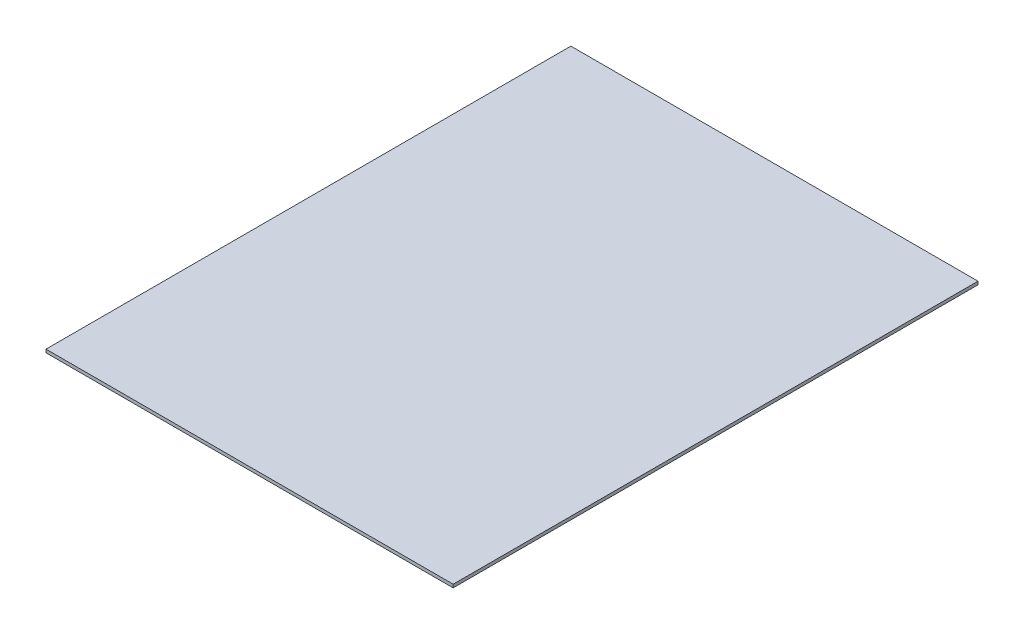
ISO-10303-21;
HEADER;
FILE_DESCRIPTION(('STEP AP214'),'2;1');
FILE_NAME('part.step','',(''),(''),'','','');
FILE_SCHEMA(('AUTOMOTIVE_DESIGN { 1 0 10303 214 1 1 1 1 }'));
ENDSEC;
DATA;
#1=APPLICATION_CONTEXT('core data for automotive mechanical design processes');
#2=APPLICATION_PROTOCOL_DEFINITION('international standard','automotive_design',2000,#1);
#3=PRODUCT_CONTEXT('',#1,'mechanical');
#4=PRODUCT('Part','Part','',(#3));
#5=PRODUCT_RELATED_PRODUCT_CATEGORY('part','',(#4));
#6=PRODUCT_DEFINITION_FORMATION('','',#4);
#7=PRODUCT_DEFINITION_CONTEXT('part definition',#1,'design');
#8=PRODUCT_DEFINITION('design','',#6,#7);
#9=PRODUCT_DEFINITION_SHAPE('','',#8);
#10=(LENGTH_UNIT() NAMED_UNIT(*) SI_UNIT(.MILLI.,.METRE.));
#11=(NAMED_UNIT(*) PLANE_ANGLE_UNIT() SI_UNIT($,.RADIAN.));
#12=(NAMED_UNIT(*) SI_UNIT($,.STERADIAN.) SOLID_ANGLE_UNIT());
#13=UNCERTAINTY_MEASURE_WITH_UNIT(LENGTH_MEASURE(1.E-05),#10,'distance_accuracy_value','');
#14=(GEOMETRIC_REPRESENTATION_CONTEXT(3) GLOBAL_UNCERTAINTY_ASSIGNED_CONTEXT((#13)) GLOBAL_UNIT_ASSIGNED_CONTEXT((#10,
#11,#12)) REPRESENTATION_CONTEXT('',''));
#15=CARTESIAN_POINT('',(0.,0.,0.));
#16=DIRECTION('',(0.,0.,1.));
#17=DIRECTION('',(1.,0.,0.));
#18=AXIS2_PLACEMENT_3D('',#15,#16,#17);
#19=CARTESIAN_POINT('',(-666.997518610422,10.,-646.352357320099));
#20=DIRECTION('',(1.,0.,0.));
#21=DIRECTION('',(0.,0.,-1.));
#22=AXIS2_PLACEMENT_3D('',#19,#20,#21);
#23=PLANE('',#22);
#24=DIRECTION('',(0.,0.,1.));
#25=VECTOR('',#24,1.);
#26=CARTESIAN_POINT('',(-666.997518610422,0.,-646.352357320099));
#27=LINE('',#26,#25);
#28=CARTESIAN_POINT('',(-666.997518610422,0.,-646.352357320099));
#29=VERTEX_POINT('',#28);
#30=CARTESIAN_POINT('',(-666.997518610422,0.,1003.6476426799));
#31=VERTEX_POINT('',#30);
#32=EDGE_CURVE('E96',#29,#31,#27,.T.);
#33=ORIENTED_EDGE('',*,*,#32,.T.);
#34=DIRECTION('',(0.,-1.,0.));
#35=VECTOR('',#34,1.);
#36=CARTESIAN_POINT('',(-666.997518610422,10.,1003.6476426799));
#37=LINE('',#36,#35);
#38=CARTESIAN_POINT('',(-666.997518610422,10.,1003.6476426799));
#39=VERTEX_POINT('',#38);
#40=EDGE_CURVE('E11',#39,#31,#37,.T.);
#41=ORIENTED_EDGE('',*,*,#40,.F.);
#42=DIRECTION('',(0.,0.,1.));
#43=VECTOR('',#42,1.);
#44=CARTESIAN_POINT('',(-666.997518610422,10.,-646.352357320099));
#45=LINE('',#44,#43);
#46=CARTESIAN_POINT('',(-666.997518610422,10.,-646.352357320099));
#47=VERTEX_POINT('',#46);
#48=EDGE_CURVE('E84',#47,#39,#45,.T.);
#49=ORIENTED_EDGE('',*,*,#48,.F.);
#50=DIRECTION('',(0.,-1.,0.));
#51=VECTOR('',#50,1.);
#52=CARTESIAN_POINT('',(-666.997518610422,10.,-646.352357320099));
#53=LINE('',#52,#51);
#54=EDGE_CURVE('E92',#47,#29,#53,.T.);
#55=ORIENTED_EDGE('',*,*,#54,.T.);
#56=EDGE_LOOP('',(#33,#41,#49,#55));
#57=FACE_BOUND('',#56,.T.);
#58=ADVANCED_FACE('F33',(#57),#23,.F.);
#59=CARTESIAN_POINT('',(-666.997518610422,10.,1003.6476426799));
#60=DIRECTION('',(0.,0.,-1.));
#61=DIRECTION('',(-1.,0.,0.));
#62=AXIS2_PLACEMENT_3D('',#59,#60,#61);
#63=PLANE('',#62);
#64=DIRECTION('',(1.,0.,0.));
#65=VECTOR('',#64,1.);
#66=CARTESIAN_POINT('',(-666.997518610422,0.,1003.6476426799));
#67=LINE('',#66,#65);
#68=CARTESIAN_POINT('',(613.002481389578,0.,1003.6476426799));
#69=VERTEX_POINT('',#68);
#70=EDGE_CURVE('E88',#31,#69,#67,.T.);
#71=ORIENTED_EDGE('',*,*,#70,.T.);
#72=DIRECTION('',(0.,-1.,0.));
#73=VECTOR('',#72,1.);
#74=CARTESIAN_POINT('',(613.002481389578,10.,1003.6476426799));
#75=LINE('',#74,#73);
#76=CARTESIAN_POINT('',(613.002481389578,10.,1003.6476426799));
#77=VERTEX_POINT('',#76);
#78=EDGE_CURVE('E41',#77,#69,#75,.T.);
#79=ORIENTED_EDGE('',*,*,#78,.F.);
#80=DIRECTION('',(1.,0.,0.));
#81=VECTOR('',#80,1.);
#82=CARTESIAN_POINT('',(-666.997518610422,10.,1003.6476426799));
#83=LINE('',#82,#81);
#84=EDGE_CURVE('E79',#39,#77,#83,.T.);
#85=ORIENTED_EDGE('',*,*,#84,.F.);
#86=ORIENTED_EDGE('',*,*,#40,.T.);
#87=EDGE_LOOP('',(#71,#79,#85,#86));
#88=FACE_BOUND('',#87,.T.);
#89=ADVANCED_FACE('F87',(#88),#63,.F.);
#90=CARTESIAN_POINT('',(613.002481389578,10.,-646.352357320099));
#91=DIRECTION('',(-1.,0.,0.));
#92=DIRECTION('',(0.,0.,1.));
#93=AXIS2_PLACEMENT_3D('',#90,#91,#92);
#94=PLANE('',#93);
#95=DIRECTION('',(0.,0.,-1.));
#96=VECTOR('',#95,1.);
#97=CARTESIAN_POINT('',(613.002481389578,0.,-646.352357320099));
#98=LINE('',#97,#96);
#99=CARTESIAN_POINT('',(613.002481389578,0.,-646.352357320099));
#100=VERTEX_POINT('',#99);
#101=EDGE_CURVE('E66',#69,#100,#98,.T.);
#102=ORIENTED_EDGE('',*,*,#101,.T.);
#103=DIRECTION('',(0.,-1.,0.));
#104=VECTOR('',#103,1.);
#105=CARTESIAN_POINT('',(613.002481389578,10.,-646.352357320099));
#106=LINE('',#105,#104);
#107=CARTESIAN_POINT('',(613.002481389578,10.,-646.352357320099));
#108=VERTEX_POINT('',#107);
#109=EDGE_CURVE('E89',#108,#100,#106,.T.);
#110=ORIENTED_EDGE('',*,*,#109,.F.);
#111=DIRECTION('',(0.,0.,-1.));
#112=VECTOR('',#111,1.);
#113=CARTESIAN_POINT('',(613.002481389578,10.,-646.352357320099));
#114=LINE('',#113,#112);
#115=EDGE_CURVE('E82',#77,#108,#114,.T.);
#116=ORIENTED_EDGE('',*,*,#115,.F.);
#117=ORIENTED_EDGE('',*,*,#78,.T.);
#118=EDGE_LOOP('',(#102,#110,#116,#117));
#119=FACE_BOUND('',#118,.T.);
#120=ADVANCED_FACE('F90',(#119),#94,.F.);
#121=CARTESIAN_POINT('',(-666.997518610422,10.,-646.352357320099));
#122=DIRECTION('',(0.,0.,1.));
#123=DIRECTION('',(1.,0.,0.));
#124=AXIS2_PLACEMENT_3D('',#121,#122,#123);
#125=PLANE('',#124);
#126=DIRECTION('',(-1.,0.,0.));
#127=VECTOR('',#126,1.);
#128=CARTESIAN_POINT('',(-666.997518610422,0.,-646.352357320099));
#129=LINE('',#128,#127);
#130=EDGE_CURVE('E72',#100,#29,#129,.T.);
#131=ORIENTED_EDGE('',*,*,#130,.T.);
#132=ORIENTED_EDGE('',*,*,#54,.F.);
#133=DIRECTION('',(-1.,0.,0.));
#134=VECTOR('',#133,1.);
#135=CARTESIAN_POINT('',(-666.997518610422,10.,-646.352357320099));
#136=LINE('',#135,#134);
#137=EDGE_CURVE('E49',#108,#47,#136,.T.);
#138=ORIENTED_EDGE('',*,*,#137,.F.);
#139=ORIENTED_EDGE('',*,*,#109,.T.);
#140=EDGE_LOOP('',(#131,#132,#138,#139));
#141=FACE_BOUND('',#140,.T.);
#142=ADVANCED_FACE('F103',(#141),#125,.F.);
#143=CARTESIAN_POINT('',(0.,10.,0.));
#144=DIRECTION('',(0.,1.,0.));
#145=DIRECTION('',(0.,0.,1.));
#146=AXIS2_PLACEMENT_3D('',#143,#144,#145);
#147=PLANE('',#146);
#148=ORIENTED_EDGE('',*,*,#48,.T.);
#149=ORIENTED_EDGE('',*,*,#84,.T.);
#150=ORIENTED_EDGE('',*,*,#115,.T.);
#151=ORIENTED_EDGE('',*,*,#137,.T.);
#152=EDGE_LOOP('',(#148,#149,#150,#151));
#153=FACE_BOUND('',#152,.T.);
#154=ADVANCED_FACE('F80',(#153),#147,.T.);
#155=CARTESIAN_POINT('',(0.,0.,0.));
#156=DIRECTION('',(0.,1.,0.));
#157=DIRECTION('',(0.,0.,1.));
#158=AXIS2_PLACEMENT_3D('',#155,#156,#157);
#159=PLANE('',#158);
#160=ORIENTED_EDGE('',*,*,#32,.F.);
#161=ORIENTED_EDGE('',*,*,#130,.F.);
#162=ORIENTED_EDGE('',*,*,#101,.F.);
#163=ORIENTED_EDGE('',*,*,#70,.F.);
#164=EDGE_LOOP('',(#160,#161,#162,#163));
#165=FACE_BOUND('',#164,.T.);
#166=ADVANCED_FACE('F106',(#165),#159,.F.);
#167=CLOSED_SHELL('',(#58,#89,#120,#142,#154,#166));
#168=MANIFOLD_SOLID_BREP('B2',#167);
#169=ADVANCED_BREP_SHAPE_REPRESENTATION('',(#18,#168),#14);
#170=SHAPE_DEFINITION_REPRESENTATION(#9,#169);
ENDSEC;
END-ISO-10303-21;
